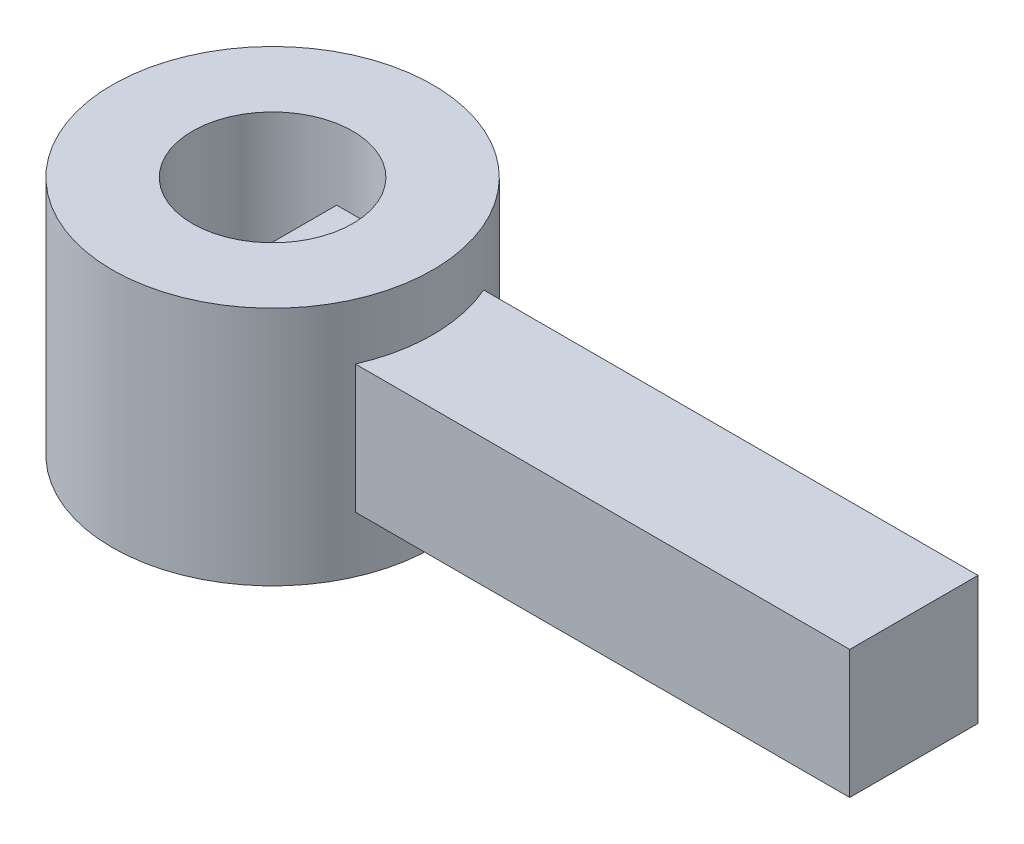
ISO-10303-21;
HEADER;
FILE_DESCRIPTION(('STEP AP214'),'2;1');
FILE_NAME('part.step','',(''),(''),'','','');
FILE_SCHEMA(('AUTOMOTIVE_DESIGN { 1 0 10303 214 1 1 1 1 }'));
ENDSEC;
DATA;
#1=APPLICATION_CONTEXT('core data for automotive mechanical design processes');
#2=APPLICATION_PROTOCOL_DEFINITION('international standard','automotive_design',2000,#1);
#3=PRODUCT_CONTEXT('',#1,'mechanical');
#4=PRODUCT('Part','Part','',(#3));
#5=PRODUCT_RELATED_PRODUCT_CATEGORY('part','',(#4));
#6=PRODUCT_DEFINITION_FORMATION('','',#4);
#7=PRODUCT_DEFINITION_CONTEXT('part definition',#1,'design');
#8=PRODUCT_DEFINITION('design','',#6,#7);
#9=PRODUCT_DEFINITION_SHAPE('','',#8);
#10=(LENGTH_UNIT() NAMED_UNIT(*) SI_UNIT(.MILLI.,.METRE.));
#11=(NAMED_UNIT(*) PLANE_ANGLE_UNIT() SI_UNIT($,.RADIAN.));
#12=(NAMED_UNIT(*) SI_UNIT($,.STERADIAN.) SOLID_ANGLE_UNIT());
#13=UNCERTAINTY_MEASURE_WITH_UNIT(LENGTH_MEASURE(1.E-05),#10,'distance_accuracy_value','');
#14=(GEOMETRIC_REPRESENTATION_CONTEXT(3) GLOBAL_UNCERTAINTY_ASSIGNED_CONTEXT((#13)) GLOBAL_UNIT_ASSIGNED_CONTEXT((#10,
#11,#12)) REPRESENTATION_CONTEXT('',''));
#15=CARTESIAN_POINT('',(0.,0.,0.));
#16=DIRECTION('',(0.,0.,1.));
#17=DIRECTION('',(1.,0.,0.));
#18=AXIS2_PLACEMENT_3D('',#15,#16,#17);
#19=CARTESIAN_POINT('',(0.,-5.715,0.));
#20=DIRECTION('',(0.,1.,0.));
#21=DIRECTION('',(0.,0.,1.));
#22=AXIS2_PLACEMENT_3D('',#19,#20,#21);
#23=CYLINDRICAL_SURFACE('',#22,3.175);
#24=CARTESIAN_POINT('',(0.,4.7625,0.));
#25=DIRECTION('',(0.,1.,0.));
#26=DIRECTION('',(0.,0.,1.));
#27=AXIS2_PLACEMENT_3D('',#24,#25,#26);
#28=CIRCLE('',#27,3.175);
#29=CARTESIAN_POINT('',(0.,4.7625,3.175));
#30=VERTEX_POINT('',#29);
#31=EDGE_CURVE('E132',#30,#30,#28,.T.);
#32=ORIENTED_EDGE('',*,*,#31,.T.);
#33=EDGE_LOOP('',(#32));
#34=FACE_BOUND('',#33,.T.);
#35=CARTESIAN_POINT('',(0.,-4.7625,0.));
#36=DIRECTION('',(0.,1.,0.));
#37=DIRECTION('',(0.,0.,1.));
#38=AXIS2_PLACEMENT_3D('',#35,#36,#37);
#39=CIRCLE('',#38,3.175);
#40=CARTESIAN_POINT('',(0.,-4.7625,3.175));
#41=VERTEX_POINT('',#40);
#42=EDGE_CURVE('E138',#41,#41,#39,.T.);
#43=ORIENTED_EDGE('',*,*,#42,.F.);
#44=EDGE_LOOP('',(#43));
#45=FACE_BOUND('',#44,.T.);
#46=DIRECTION('',(0.,1.,0.));
#47=VECTOR('',#46,1.);
#48=CARTESIAN_POINT('',(1.905,-5.715,2.54));
#49=LINE('',#48,#47);
#50=CARTESIAN_POINT('',(1.905,-2.54,2.54));
#51=VERTEX_POINT('',#50);
#52=CARTESIAN_POINT('',(1.905,2.54,2.54));
#53=VERTEX_POINT('',#52);
#54=EDGE_CURVE('E49',#51,#53,#49,.T.);
#55=ORIENTED_EDGE('',*,*,#54,.F.);
#56=CARTESIAN_POINT('',(0.,-2.54,0.));
#57=DIRECTION('',(0.,1.,0.));
#58=DIRECTION('',(0.,0.,1.));
#59=AXIS2_PLACEMENT_3D('',#56,#57,#58);
#60=CIRCLE('',#59,3.175);
#61=CARTESIAN_POINT('',(1.905,-2.54,-2.54));
#62=VERTEX_POINT('',#61);
#63=EDGE_CURVE('E53',#62,#51,#60,.F.);
#64=ORIENTED_EDGE('',*,*,#63,.F.);
#65=DIRECTION('',(0.,1.,0.));
#66=VECTOR('',#65,1.);
#67=CARTESIAN_POINT('',(1.905,-5.715,-2.54));
#68=LINE('',#67,#66);
#69=CARTESIAN_POINT('',(1.905,2.54,-2.54));
#70=VERTEX_POINT('',#69);
#71=EDGE_CURVE('E124',#70,#62,#68,.F.);
#72=ORIENTED_EDGE('',*,*,#71,.F.);
#73=CARTESIAN_POINT('',(0.,2.54,0.));
#74=DIRECTION('',(0.,-1.,0.));
#75=DIRECTION('',(0.,0.,-1.));
#76=AXIS2_PLACEMENT_3D('',#73,#74,#75);
#77=CIRCLE('',#76,3.175);
#78=EDGE_CURVE('E120',#53,#70,#77,.F.);
#79=ORIENTED_EDGE('',*,*,#78,.F.);
#80=EDGE_LOOP('',(#55,#64,#72,#79));
#81=FACE_BOUND('',#80,.T.);
#82=ADVANCED_FACE('F35',(#34,#45,#81),#23,.F.);
#83=CARTESIAN_POINT('',(0.,-4.7625,0.));
#84=DIRECTION('',(0.,1.,0.));
#85=DIRECTION('',(0.,0.,1.));
#86=AXIS2_PLACEMENT_3D('',#83,#84,#85);
#87=CYLINDRICAL_SURFACE('',#86,6.35);
#88=CARTESIAN_POINT('',(0.,4.7625,0.));
#89=DIRECTION('',(0.,1.,0.));
#90=DIRECTION('',(0.,0.,1.));
#91=AXIS2_PLACEMENT_3D('',#88,#89,#90);
#92=CIRCLE('',#91,6.35);
#93=CARTESIAN_POINT('',(0.,4.7625,6.35));
#94=VERTEX_POINT('',#93);
#95=EDGE_CURVE('E135',#94,#94,#92,.T.);
#96=ORIENTED_EDGE('',*,*,#95,.F.);
#97=EDGE_LOOP('',(#96));
#98=FACE_BOUND('',#97,.T.);
#99=CARTESIAN_POINT('',(0.,-4.7625,0.));
#100=DIRECTION('',(0.,1.,0.));
#101=DIRECTION('',(0.,0.,1.));
#102=AXIS2_PLACEMENT_3D('',#99,#100,#101);
#103=CIRCLE('',#102,6.35);
#104=CARTESIAN_POINT('',(0.,-4.7625,6.35));
#105=VERTEX_POINT('',#104);
#106=EDGE_CURVE('E141',#105,#105,#103,.T.);
#107=ORIENTED_EDGE('',*,*,#106,.T.);
#108=EDGE_LOOP('',(#107));
#109=FACE_BOUND('',#108,.T.);
#110=CARTESIAN_POINT('',(0.,-2.54,0.));
#111=DIRECTION('',(0.,1.,0.));
#112=DIRECTION('',(0.,0.,1.));
#113=AXIS2_PLACEMENT_3D('',#110,#111,#112);
#114=CIRCLE('',#113,6.35);
#115=CARTESIAN_POINT('',(5.81987113259392,-2.54,-2.54));
#116=VERTEX_POINT('',#115);
#117=CARTESIAN_POINT('',(5.81987113259392,-2.54,2.54));
#118=VERTEX_POINT('',#117);
#119=EDGE_CURVE('E42',#116,#118,#114,.F.);
#120=ORIENTED_EDGE('',*,*,#119,.T.);
#121=DIRECTION('',(0.,1.,0.));
#122=VECTOR('',#121,1.);
#123=CARTESIAN_POINT('',(5.81987113259392,-4.7625,2.54));
#124=LINE('',#123,#122);
#125=CARTESIAN_POINT('',(5.81987113259392,2.54,2.54));
#126=VERTEX_POINT('',#125);
#127=EDGE_CURVE('E11',#118,#126,#124,.T.);
#128=ORIENTED_EDGE('',*,*,#127,.T.);
#129=CARTESIAN_POINT('',(0.,2.54,0.));
#130=DIRECTION('',(0.,-1.,0.));
#131=DIRECTION('',(0.,0.,-1.));
#132=AXIS2_PLACEMENT_3D('',#129,#130,#131);
#133=CIRCLE('',#132,6.35);
#134=CARTESIAN_POINT('',(5.81987113259392,2.54,-2.54));
#135=VERTEX_POINT('',#134);
#136=EDGE_CURVE('E144',#126,#135,#133,.F.);
#137=ORIENTED_EDGE('',*,*,#136,.T.);
#138=DIRECTION('',(0.,1.,0.));
#139=VECTOR('',#138,1.);
#140=CARTESIAN_POINT('',(5.81987113259392,-4.7625,-2.54));
#141=LINE('',#140,#139);
#142=EDGE_CURVE('E147',#135,#116,#141,.F.);
#143=ORIENTED_EDGE('',*,*,#142,.T.);
#144=EDGE_LOOP('',(#120,#128,#137,#143));
#145=FACE_BOUND('',#144,.T.);
#146=ADVANCED_FACE('F150',(#98,#109,#145),#87,.T.);
#147=CARTESIAN_POINT('',(0.,-4.7625,0.));
#148=DIRECTION('',(0.,1.,0.));
#149=DIRECTION('',(0.,0.,1.));
#150=AXIS2_PLACEMENT_3D('',#147,#148,#149);
#151=PLANE('',#150);
#152=ORIENTED_EDGE('',*,*,#42,.T.);
#153=EDGE_LOOP('',(#152));
#154=FACE_BOUND('',#153,.T.);
#155=ORIENTED_EDGE('',*,*,#106,.F.);
#156=EDGE_LOOP('',(#155));
#157=FACE_BOUND('',#156,.T.);
#158=ADVANCED_FACE('F198',(#154,#157),#151,.F.);
#159=CARTESIAN_POINT('',(0.,4.7625,0.));
#160=DIRECTION('',(0.,1.,0.));
#161=DIRECTION('',(0.,0.,1.));
#162=AXIS2_PLACEMENT_3D('',#159,#160,#161);
#163=PLANE('',#162);
#164=ORIENTED_EDGE('',*,*,#95,.T.);
#165=EDGE_LOOP('',(#164));
#166=FACE_BOUND('',#165,.T.);
#167=ORIENTED_EDGE('',*,*,#31,.F.);
#168=EDGE_LOOP('',(#167));
#169=FACE_BOUND('',#168,.T.);
#170=ADVANCED_FACE('F187',(#166,#169),#163,.T.);
#171=CARTESIAN_POINT('',(25.4,0.,0.));
#172=DIRECTION('',(-1.,0.,0.));
#173=DIRECTION('',(0.,0.,1.));
#174=AXIS2_PLACEMENT_3D('',#171,#172,#173);
#175=PLANE('',#174);
#176=DIRECTION('',(0.,-1.,0.));
#177=VECTOR('',#176,1.);
#178=CARTESIAN_POINT('',(25.4,2.54,2.54));
#179=LINE('',#178,#177);
#180=CARTESIAN_POINT('',(25.4,2.54,2.54));
#181=VERTEX_POINT('',#180);
#182=CARTESIAN_POINT('',(25.4,-2.54,2.54));
#183=VERTEX_POINT('',#182);
#184=EDGE_CURVE('E108',#181,#183,#179,.T.);
#185=ORIENTED_EDGE('',*,*,#184,.T.);
#186=DIRECTION('',(0.,0.,-1.));
#187=VECTOR('',#186,1.);
#188=CARTESIAN_POINT('',(25.4,-2.54,-2.54));
#189=LINE('',#188,#187);
#190=CARTESIAN_POINT('',(25.4,-2.54,-2.54));
#191=VERTEX_POINT('',#190);
#192=EDGE_CURVE('E97',#183,#191,#189,.T.);
#193=ORIENTED_EDGE('',*,*,#192,.T.);
#194=DIRECTION('',(0.,1.,0.));
#195=VECTOR('',#194,1.);
#196=CARTESIAN_POINT('',(25.4,2.54,-2.54));
#197=LINE('',#196,#195);
#198=CARTESIAN_POINT('',(25.4,2.54,-2.54));
#199=VERTEX_POINT('',#198);
#200=EDGE_CURVE('E107',#191,#199,#197,.T.);
#201=ORIENTED_EDGE('',*,*,#200,.T.);
#202=DIRECTION('',(0.,0.,1.));
#203=VECTOR('',#202,1.);
#204=CARTESIAN_POINT('',(25.4,2.54,-2.54));
#205=LINE('',#204,#203);
#206=EDGE_CURVE('E113',#199,#181,#205,.T.);
#207=ORIENTED_EDGE('',*,*,#206,.T.);
#208=EDGE_LOOP('',(#185,#193,#201,#207));
#209=FACE_BOUND('',#208,.T.);
#210=ADVANCED_FACE('F111',(#209),#175,.F.);
#211=CARTESIAN_POINT('',(25.4,2.54,-2.54));
#212=DIRECTION('',(0.,-1.,0.));
#213=DIRECTION('',(0.,0.,-1.));
#214=AXIS2_PLACEMENT_3D('',#211,#212,#213);
#215=PLANE('',#214);
#216=ORIENTED_EDGE('',*,*,#136,.F.);
#217=DIRECTION('',(-1.,0.,0.));
#218=VECTOR('',#217,1.);
#219=CARTESIAN_POINT('',(25.4,2.54,2.54));
#220=LINE('',#219,#218);
#221=EDGE_CURVE('E163',#181,#126,#220,.T.);
#222=ORIENTED_EDGE('',*,*,#221,.F.);
#223=ORIENTED_EDGE('',*,*,#206,.F.);
#224=DIRECTION('',(-1.,0.,0.));
#225=VECTOR('',#224,1.);
#226=CARTESIAN_POINT('',(25.4,2.54,-2.54));
#227=LINE('',#226,#225);
#228=EDGE_CURVE('E156',#199,#135,#227,.T.);
#229=ORIENTED_EDGE('',*,*,#228,.T.);
#230=EDGE_LOOP('',(#216,#222,#223,#229));
#231=FACE_BOUND('',#230,.T.);
#232=ADVANCED_FACE('F177',(#231),#215,.F.);
#233=CARTESIAN_POINT('',(25.4,2.54,-2.54));
#234=DIRECTION('',(0.,0.,1.));
#235=DIRECTION('',(0.,-1.,0.));
#236=AXIS2_PLACEMENT_3D('',#233,#234,#235);
#237=PLANE('',#236);
#238=ORIENTED_EDGE('',*,*,#142,.F.);
#239=ORIENTED_EDGE('',*,*,#228,.F.);
#240=ORIENTED_EDGE('',*,*,#200,.F.);
#241=DIRECTION('',(-1.,0.,0.));
#242=VECTOR('',#241,1.);
#243=CARTESIAN_POINT('',(25.4,-2.54,-2.54));
#244=LINE('',#243,#242);
#245=EDGE_CURVE('E104',#191,#116,#244,.T.);
#246=ORIENTED_EDGE('',*,*,#245,.T.);
#247=EDGE_LOOP('',(#238,#239,#240,#246));
#248=FACE_BOUND('',#247,.T.);
#249=ADVANCED_FACE('F153',(#248),#237,.F.);
#250=CARTESIAN_POINT('',(25.4,-2.54,-2.54));
#251=DIRECTION('',(0.,1.,0.));
#252=DIRECTION('',(0.,0.,1.));
#253=AXIS2_PLACEMENT_3D('',#250,#251,#252);
#254=PLANE('',#253);
#255=ORIENTED_EDGE('',*,*,#119,.F.);
#256=ORIENTED_EDGE('',*,*,#245,.F.);
#257=ORIENTED_EDGE('',*,*,#192,.F.);
#258=DIRECTION('',(-1.,0.,0.));
#259=VECTOR('',#258,1.);
#260=CARTESIAN_POINT('',(25.4,-2.54,2.54));
#261=LINE('',#260,#259);
#262=EDGE_CURVE('E101',#183,#118,#261,.T.);
#263=ORIENTED_EDGE('',*,*,#262,.T.);
#264=EDGE_LOOP('',(#255,#256,#257,#263));
#265=FACE_BOUND('',#264,.T.);
#266=ADVANCED_FACE('F99',(#265),#254,.F.);
#267=CARTESIAN_POINT('',(25.4,2.54,2.54));
#268=DIRECTION('',(0.,0.,-1.));
#269=DIRECTION('',(0.,1.,0.));
#270=AXIS2_PLACEMENT_3D('',#267,#268,#269);
#271=PLANE('',#270);
#272=ORIENTED_EDGE('',*,*,#127,.F.);
#273=ORIENTED_EDGE('',*,*,#262,.F.);
#274=ORIENTED_EDGE('',*,*,#184,.F.);
#275=ORIENTED_EDGE('',*,*,#221,.T.);
#276=EDGE_LOOP('',(#272,#273,#274,#275));
#277=FACE_BOUND('',#276,.T.);
#278=ADVANCED_FACE('F119',(#277),#271,.F.);
#279=CARTESIAN_POINT('',(0.,-2.54,2.54));
#280=VERTEX_POINT('',#279);
#281=EDGE_CURVE('E121',#51,#280,#261,.T.);
#282=ORIENTED_EDGE('',*,*,#281,.F.);
#283=ORIENTED_EDGE('',*,*,#54,.T.);
#284=CARTESIAN_POINT('',(0.,2.54,2.54));
#285=VERTEX_POINT('',#284);
#286=EDGE_CURVE('E166',#53,#285,#220,.T.);
#287=ORIENTED_EDGE('',*,*,#286,.T.);
#288=DIRECTION('',(0.,-1.,0.));
#289=VECTOR('',#288,1.);
#290=CARTESIAN_POINT('',(0.,2.54,2.54));
#291=LINE('',#290,#289);
#292=EDGE_CURVE('E173',#285,#280,#291,.T.);
#293=ORIENTED_EDGE('',*,*,#292,.T.);
#294=EDGE_LOOP('',(#282,#283,#287,#293));
#295=FACE_BOUND('',#294,.T.);
#296=ADVANCED_FACE('F217',(#295),#271,.F.);
#297=CARTESIAN_POINT('',(0.,-2.54,-2.54));
#298=VERTEX_POINT('',#297);
#299=EDGE_CURVE('E155',#62,#298,#244,.T.);
#300=ORIENTED_EDGE('',*,*,#299,.F.);
#301=ORIENTED_EDGE('',*,*,#63,.T.);
#302=ORIENTED_EDGE('',*,*,#281,.T.);
#303=DIRECTION('',(0.,0.,-1.));
#304=VECTOR('',#303,1.);
#305=CARTESIAN_POINT('',(0.,-2.54,-2.54));
#306=LINE('',#305,#304);
#307=EDGE_CURVE('E171',#280,#298,#306,.T.);
#308=ORIENTED_EDGE('',*,*,#307,.T.);
#309=EDGE_LOOP('',(#300,#301,#302,#308));
#310=FACE_BOUND('',#309,.T.);
#311=ADVANCED_FACE('F219',(#310),#254,.F.);
#312=CARTESIAN_POINT('',(0.,2.54,-2.54));
#313=VERTEX_POINT('',#312);
#314=EDGE_CURVE('E161',#70,#313,#227,.T.);
#315=ORIENTED_EDGE('',*,*,#314,.F.);
#316=ORIENTED_EDGE('',*,*,#71,.T.);
#317=ORIENTED_EDGE('',*,*,#299,.T.);
#318=DIRECTION('',(0.,1.,0.));
#319=VECTOR('',#318,1.);
#320=CARTESIAN_POINT('',(0.,2.54,-2.54));
#321=LINE('',#320,#319);
#322=EDGE_CURVE('E169',#298,#313,#321,.T.);
#323=ORIENTED_EDGE('',*,*,#322,.T.);
#324=EDGE_LOOP('',(#315,#316,#317,#323));
#325=FACE_BOUND('',#324,.T.);
#326=ADVANCED_FACE('F186',(#325),#237,.F.);
#327=ORIENTED_EDGE('',*,*,#286,.F.);
#328=ORIENTED_EDGE('',*,*,#78,.T.);
#329=ORIENTED_EDGE('',*,*,#314,.T.);
#330=DIRECTION('',(0.,0.,1.));
#331=VECTOR('',#330,1.);
#332=CARTESIAN_POINT('',(0.,2.54,-2.54));
#333=LINE('',#332,#331);
#334=EDGE_CURVE('E117',#313,#285,#333,.T.);
#335=ORIENTED_EDGE('',*,*,#334,.T.);
#336=EDGE_LOOP('',(#327,#328,#329,#335));
#337=FACE_BOUND('',#336,.T.);
#338=ADVANCED_FACE('F180',(#337),#215,.F.);
#339=CARTESIAN_POINT('',(0.,0.,0.));
#340=DIRECTION('',(-1.,0.,0.));
#341=DIRECTION('',(0.,0.,1.));
#342=AXIS2_PLACEMENT_3D('',#339,#340,#341);
#343=PLANE('',#342);
#344=ORIENTED_EDGE('',*,*,#292,.F.);
#345=ORIENTED_EDGE('',*,*,#334,.F.);
#346=ORIENTED_EDGE('',*,*,#322,.F.);
#347=ORIENTED_EDGE('',*,*,#307,.F.);
#348=EDGE_LOOP('',(#344,#345,#346,#347));
#349=FACE_BOUND('',#348,.T.);
#350=ADVANCED_FACE('F191',(#349),#343,.T.);
#351=CLOSED_SHELL('',(#82,#146,#158,#170,#210,#232,#249,#266,#278,#296,#311,#326,#338,#350));
#352=MANIFOLD_SOLID_BREP('B2',#351);
#353=ADVANCED_BREP_SHAPE_REPRESENTATION('',(#18,#352),#14);
#354=SHAPE_DEFINITION_REPRESENTATION(#9,#353);
ENDSEC;
END-ISO-10303-21;
